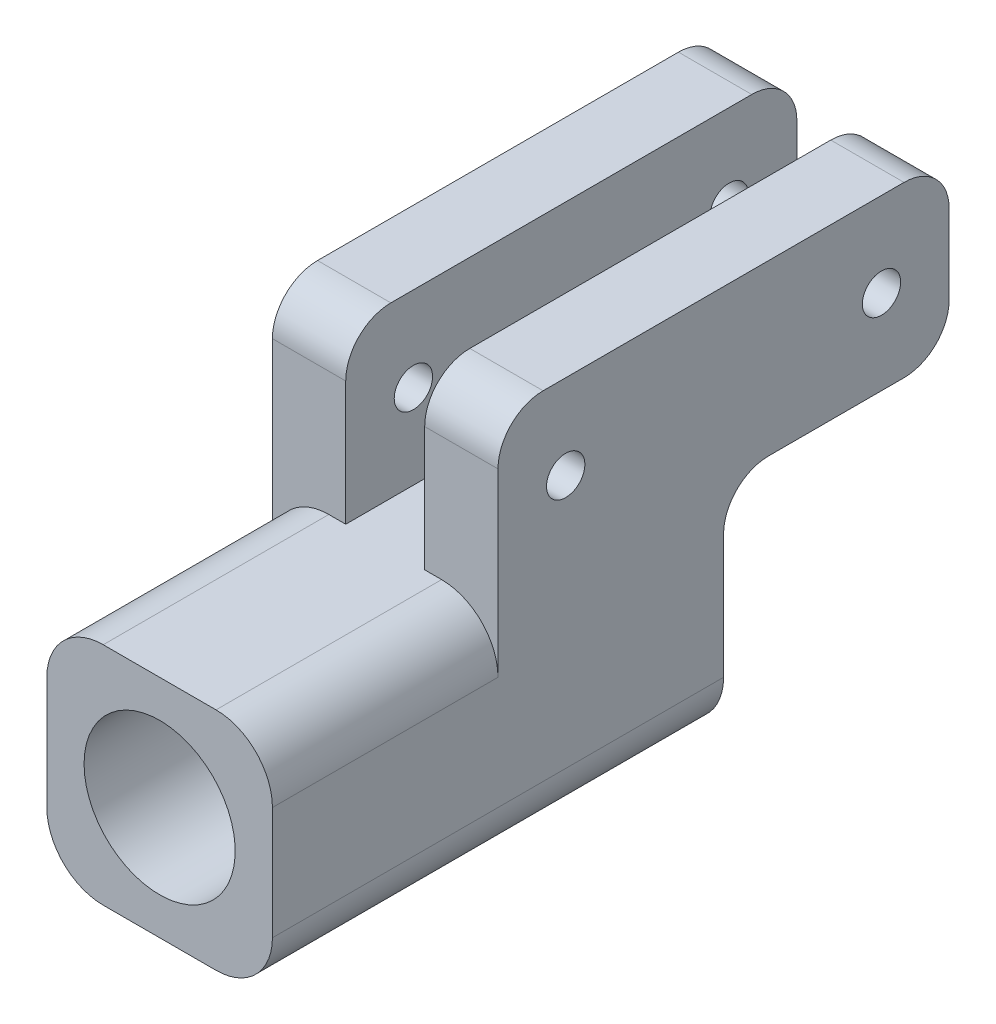
ISO-10303-21;
HEADER;
FILE_DESCRIPTION(('STEP AP214'),'2;1');
FILE_NAME('part.step','',(''),(''),'','','');
FILE_SCHEMA(('AUTOMOTIVE_DESIGN { 1 0 10303 214 1 1 1 1 }'));
ENDSEC;
DATA;
#1=APPLICATION_CONTEXT('core data for automotive mechanical design processes');
#2=APPLICATION_PROTOCOL_DEFINITION('international standard','automotive_design',2000,#1);
#3=PRODUCT_CONTEXT('',#1,'mechanical');
#4=PRODUCT('Part','Part','',(#3));
#5=PRODUCT_RELATED_PRODUCT_CATEGORY('part','',(#4));
#6=PRODUCT_DEFINITION_FORMATION('','',#4);
#7=PRODUCT_DEFINITION_CONTEXT('part definition',#1,'design');
#8=PRODUCT_DEFINITION('design','',#6,#7);
#9=PRODUCT_DEFINITION_SHAPE('','',#8);
#10=(LENGTH_UNIT() NAMED_UNIT(*) SI_UNIT(.MILLI.,.METRE.));
#11=(NAMED_UNIT(*) PLANE_ANGLE_UNIT() SI_UNIT($,.RADIAN.));
#12=(NAMED_UNIT(*) SI_UNIT($,.STERADIAN.) SOLID_ANGLE_UNIT());
#13=UNCERTAINTY_MEASURE_WITH_UNIT(LENGTH_MEASURE(1.E-05),#10,'distance_accuracy_value','');
#14=(GEOMETRIC_REPRESENTATION_CONTEXT(3) GLOBAL_UNCERTAINTY_ASSIGNED_CONTEXT((#13)) GLOBAL_UNIT_ASSIGNED_CONTEXT((#10,
#11,#12)) REPRESENTATION_CONTEXT('',''));
#15=CARTESIAN_POINT('',(0.,0.,0.));
#16=DIRECTION('',(0.,0.,1.));
#17=DIRECTION('',(1.,0.,0.));
#18=AXIS2_PLACEMENT_3D('',#15,#16,#17);
#19=CARTESIAN_POINT('',(10.,10.,-40.));
#20=DIRECTION('',(0.,1.,0.));
#21=DIRECTION('',(0.,0.,1.));
#22=AXIS2_PLACEMENT_3D('',#19,#20,#21);
#23=PLANE('',#22);
#24=DIRECTION('',(0.,0.,-1.));
#25=VECTOR('',#24,1.);
#26=CARTESIAN_POINT('',(-3.5,10.,-40.));
#27=LINE('',#26,#25);
#28=CARTESIAN_POINT('',(-3.5,10.,-24.));
#29=VERTEX_POINT('',#28);
#30=CARTESIAN_POINT('',(-3.5,10.,-36.));
#31=VERTEX_POINT('',#30);
#32=EDGE_CURVE('E460',#29,#31,#27,.T.);
#33=ORIENTED_EDGE('',*,*,#32,.F.);
#34=DIRECTION('',(-1.,0.,0.));
#35=VECTOR('',#34,1.);
#36=CARTESIAN_POINT('',(-10.,10.,-24.));
#37=LINE('',#36,#35);
#38=CARTESIAN_POINT('',(-10.,10.,-24.));
#39=VERTEX_POINT('',#38);
#40=EDGE_CURVE('E309',#29,#39,#37,.T.);
#41=ORIENTED_EDGE('',*,*,#40,.T.);
#42=DIRECTION('',(0.,0.,-1.));
#43=VECTOR('',#42,1.);
#44=CARTESIAN_POINT('',(-10.,10.,-40.));
#45=LINE('',#44,#43);
#46=CARTESIAN_POINT('',(-10.,10.,-36.));
#47=VERTEX_POINT('',#46);
#48=EDGE_CURVE('E253',#39,#47,#45,.T.);
#49=ORIENTED_EDGE('',*,*,#48,.T.);
#50=DIRECTION('',(-1.,0.,0.));
#51=VECTOR('',#50,1.);
#52=CARTESIAN_POINT('',(10.,10.,-36.));
#53=LINE('',#52,#51);
#54=EDGE_CURVE('E298',#47,#31,#53,.F.);
#55=ORIENTED_EDGE('',*,*,#54,.T.);
#56=EDGE_LOOP('',(#33,#41,#49,#55));
#57=FACE_BOUND('',#56,.T.);
#58=ADVANCED_FACE('F34',(#57),#23,.F.);
#59=CARTESIAN_POINT('',(10.,25.,-40.));
#60=DIRECTION('',(0.,0.,1.));
#61=DIRECTION('',(1.,0.,0.));
#62=AXIS2_PLACEMENT_3D('',#59,#60,#61);
#63=PLANE('',#62);
#64=DIRECTION('',(0.,1.,0.));
#65=VECTOR('',#64,1.);
#66=CARTESIAN_POINT('',(-10.,25.,-40.));
#67=LINE('',#66,#65);
#68=CARTESIAN_POINT('',(-10.,14.,-40.));
#69=VERTEX_POINT('',#68);
#70=CARTESIAN_POINT('',(-10.,21.,-40.));
#71=VERTEX_POINT('',#70);
#72=EDGE_CURVE('E268',#69,#71,#67,.T.);
#73=ORIENTED_EDGE('',*,*,#72,.T.);
#74=DIRECTION('',(-1.,0.,0.));
#75=VECTOR('',#74,1.);
#76=CARTESIAN_POINT('',(10.,21.,-40.));
#77=LINE('',#76,#75);
#78=CARTESIAN_POINT('',(-3.5,21.,-40.));
#79=VERTEX_POINT('',#78);
#80=EDGE_CURVE('E339',#71,#79,#77,.F.);
#81=ORIENTED_EDGE('',*,*,#80,.T.);
#82=DIRECTION('',(0.,1.,0.));
#83=VECTOR('',#82,1.);
#84=CARTESIAN_POINT('',(-3.5,-30.6078810084939,-40.));
#85=LINE('',#84,#83);
#86=CARTESIAN_POINT('',(-3.5,14.,-40.));
#87=VERTEX_POINT('',#86);
#88=EDGE_CURVE('E243',#87,#79,#85,.T.);
#89=ORIENTED_EDGE('',*,*,#88,.F.);
#90=DIRECTION('',(-1.,0.,0.));
#91=VECTOR('',#90,1.);
#92=CARTESIAN_POINT('',(10.,14.,-40.));
#93=LINE('',#92,#91);
#94=EDGE_CURVE('E336',#87,#69,#93,.T.);
#95=ORIENTED_EDGE('',*,*,#94,.T.);
#96=EDGE_LOOP('',(#73,#81,#89,#95));
#97=FACE_BOUND('',#96,.T.);
#98=ADVANCED_FACE('F491',(#97),#63,.F.);
#99=CARTESIAN_POINT('',(10.,25.,0.));
#100=DIRECTION('',(0.,-1.,0.));
#101=DIRECTION('',(0.,0.,-1.));
#102=AXIS2_PLACEMENT_3D('',#99,#100,#101);
#103=PLANE('',#102);
#104=DIRECTION('',(0.,0.,1.));
#105=VECTOR('',#104,1.);
#106=CARTESIAN_POINT('',(-3.5,25.,-40.));
#107=LINE('',#106,#105);
#108=CARTESIAN_POINT('',(-3.5,25.,-36.));
#109=VERTEX_POINT('',#108);
#110=CARTESIAN_POINT('',(-3.5,25.,-4.));
#111=VERTEX_POINT('',#110);
#112=EDGE_CURVE('E240',#109,#111,#107,.T.);
#113=ORIENTED_EDGE('',*,*,#112,.F.);
#114=DIRECTION('',(-1.,0.,0.));
#115=VECTOR('',#114,1.);
#116=CARTESIAN_POINT('',(10.,25.,-36.));
#117=LINE('',#116,#115);
#118=CARTESIAN_POINT('',(-10.,25.,-36.));
#119=VERTEX_POINT('',#118);
#120=EDGE_CURVE('E327',#109,#119,#117,.T.);
#121=ORIENTED_EDGE('',*,*,#120,.T.);
#122=DIRECTION('',(0.,0.,1.));
#123=VECTOR('',#122,1.);
#124=CARTESIAN_POINT('',(-10.,25.,0.));
#125=LINE('',#124,#123);
#126=CARTESIAN_POINT('',(-10.,25.,-4.));
#127=VERTEX_POINT('',#126);
#128=EDGE_CURVE('E271',#119,#127,#125,.T.);
#129=ORIENTED_EDGE('',*,*,#128,.T.);
#130=DIRECTION('',(-1.,0.,0.));
#131=VECTOR('',#130,1.);
#132=CARTESIAN_POINT('',(10.,25.,-4.));
#133=LINE('',#132,#131);
#134=EDGE_CURVE('E325',#127,#111,#133,.F.);
#135=ORIENTED_EDGE('',*,*,#134,.T.);
#136=EDGE_LOOP('',(#113,#121,#129,#135));
#137=FACE_BOUND('',#136,.T.);
#138=ADVANCED_FACE('F477',(#137),#103,.F.);
#139=CARTESIAN_POINT('',(10.,10.,0.));
#140=DIRECTION('',(0.,0.,-1.));
#141=DIRECTION('',(0.,1.,0.));
#142=AXIS2_PLACEMENT_3D('',#139,#140,#141);
#143=PLANE('',#142);
#144=DIRECTION('',(0.,1.,0.));
#145=VECTOR('',#144,1.);
#146=CARTESIAN_POINT('',(-3.5,-30.6078810084939,0.));
#147=LINE('',#146,#145);
#148=CARTESIAN_POINT('',(-3.5,10.,0.));
#149=VERTEX_POINT('',#148);
#150=CARTESIAN_POINT('',(-3.5,21.,0.));
#151=VERTEX_POINT('',#150);
#152=EDGE_CURVE('E459',#149,#151,#147,.T.);
#153=ORIENTED_EDGE('',*,*,#152,.T.);
#154=DIRECTION('',(-1.,0.,0.));
#155=VECTOR('',#154,1.);
#156=CARTESIAN_POINT('',(10.,21.,0.));
#157=LINE('',#156,#155);
#158=CARTESIAN_POINT('',(-10.,21.,0.));
#159=VERTEX_POINT('',#158);
#160=EDGE_CURVE('E370',#151,#159,#157,.T.);
#161=ORIENTED_EDGE('',*,*,#160,.T.);
#162=DIRECTION('',(0.,-1.,0.));
#163=VECTOR('',#162,1.);
#164=CARTESIAN_POINT('',(-10.,10.,0.));
#165=LINE('',#164,#163);
#166=CARTESIAN_POINT('',(-10.,5.,0.));
#167=VERTEX_POINT('',#166);
#168=EDGE_CURVE('E258',#159,#167,#165,.T.);
#169=ORIENTED_EDGE('',*,*,#168,.T.);
#170=CARTESIAN_POINT('',(-5.,5.,0.));
#171=DIRECTION('',(0.,0.,-1.));
#172=DIRECTION('',(0.,1.,0.));
#173=AXIS2_PLACEMENT_3D('',#170,#171,#172);
#174=CIRCLE('',#173,5.);
#175=CARTESIAN_POINT('',(-5.,10.,0.));
#176=VERTEX_POINT('',#175);
#177=EDGE_CURVE('E42',#167,#176,#174,.T.);
#178=ORIENTED_EDGE('',*,*,#177,.T.);
#179=DIRECTION('',(-1.,0.,0.));
#180=VECTOR('',#179,1.);
#181=CARTESIAN_POINT('',(10.,10.,0.));
#182=LINE('',#181,#180);
#183=EDGE_CURVE('E221',#149,#176,#182,.T.);
#184=ORIENTED_EDGE('',*,*,#183,.F.);
#185=EDGE_LOOP('',(#153,#161,#169,#178,#184));
#186=FACE_BOUND('',#185,.T.);
#187=ADVANCED_FACE('F413',(#186),#143,.F.);
#188=CARTESIAN_POINT('',(10.,10.,20.));
#189=DIRECTION('',(-1.,0.,0.));
#190=DIRECTION('',(0.,0.,1.));
#191=AXIS2_PLACEMENT_3D('',#188,#189,#190);
#192=PLANE('',#191);
#193=CARTESIAN_POINT('',(10.,17.5,-6.));
#194=DIRECTION('',(1.,0.,0.));
#195=DIRECTION('',(0.,0.,-1.));
#196=AXIS2_PLACEMENT_3D('',#193,#194,#195);
#197=CIRCLE('',#196,1.7);
#198=CARTESIAN_POINT('',(10.,17.5,-7.7));
#199=VERTEX_POINT('',#198);
#200=EDGE_CURVE('E805',#199,#199,#197,.T.);
#201=ORIENTED_EDGE('',*,*,#200,.F.);
#202=EDGE_LOOP('',(#201));
#203=FACE_BOUND('',#202,.T.);
#204=CARTESIAN_POINT('',(10.,17.5,-34.));
#205=DIRECTION('',(1.,0.,0.));
#206=DIRECTION('',(0.,0.,1.));
#207=AXIS2_PLACEMENT_3D('',#204,#205,#206);
#208=CIRCLE('',#207,1.70000000000001);
#209=CARTESIAN_POINT('',(10.,17.5,-32.3));
#210=VERTEX_POINT('',#209);
#211=EDGE_CURVE('E806',#210,#210,#208,.T.);
#212=ORIENTED_EDGE('',*,*,#211,.F.);
#213=EDGE_LOOP('',(#212));
#214=FACE_BOUND('',#213,.T.);
#215=DIRECTION('',(0.,-1.,0.));
#216=VECTOR('',#215,1.);
#217=CARTESIAN_POINT('',(10.,10.,0.));
#218=LINE('',#217,#216);
#219=CARTESIAN_POINT('',(10.,21.,0.));
#220=VERTEX_POINT('',#219);
#221=CARTESIAN_POINT('',(10.,5.,0.));
#222=VERTEX_POINT('',#221);
#223=EDGE_CURVE('E264',#220,#222,#218,.T.);
#224=ORIENTED_EDGE('',*,*,#223,.T.);
#225=DIRECTION('',(0.,0.,-1.));
#226=VECTOR('',#225,1.);
#227=CARTESIAN_POINT('',(10.,5.,20.));
#228=LINE('',#227,#226);
#229=CARTESIAN_POINT('',(10.,5.,20.));
#230=VERTEX_POINT('',#229);
#231=EDGE_CURVE('E402',#222,#230,#228,.F.);
#232=ORIENTED_EDGE('',*,*,#231,.T.);
#233=DIRECTION('',(0.,-1.,0.));
#234=VECTOR('',#233,1.);
#235=CARTESIAN_POINT('',(10.,10.,20.));
#236=LINE('',#235,#234);
#237=CARTESIAN_POINT('',(10.,-5.,20.));
#238=VERTEX_POINT('',#237);
#239=EDGE_CURVE('E283',#230,#238,#236,.T.);
#240=ORIENTED_EDGE('',*,*,#239,.T.);
#241=DIRECTION('',(0.,0.,-1.));
#242=VECTOR('',#241,1.);
#243=CARTESIAN_POINT('',(10.,-5.,-20.));
#244=LINE('',#243,#242);
#245=CARTESIAN_POINT('',(10.,-5.,-20.));
#246=VERTEX_POINT('',#245);
#247=EDGE_CURVE('E399',#238,#246,#244,.T.);
#248=ORIENTED_EDGE('',*,*,#247,.T.);
#249=DIRECTION('',(0.,-1.,0.));
#250=VECTOR('',#249,1.);
#251=CARTESIAN_POINT('',(10.,10.,-20.));
#252=LINE('',#251,#250);
#253=CARTESIAN_POINT('',(10.,6.,-20.));
#254=VERTEX_POINT('',#253);
#255=EDGE_CURVE('E296',#254,#246,#252,.T.);
#256=ORIENTED_EDGE('',*,*,#255,.F.);
#257=CARTESIAN_POINT('',(10.,6.,-24.));
#258=DIRECTION('',(-1.,0.,0.));
#259=DIRECTION('',(0.,0.,1.));
#260=AXIS2_PLACEMENT_3D('',#257,#258,#259);
#261=CIRCLE('',#260,4.);
#262=CARTESIAN_POINT('',(10.,10.,-24.));
#263=VERTEX_POINT('',#262);
#264=EDGE_CURVE('E379',#254,#263,#261,.T.);
#265=ORIENTED_EDGE('',*,*,#264,.T.);
#266=DIRECTION('',(0.,0.,-1.));
#267=VECTOR('',#266,1.);
#268=CARTESIAN_POINT('',(10.,10.,-40.));
#269=LINE('',#268,#267);
#270=CARTESIAN_POINT('',(10.,10.,-36.));
#271=VERTEX_POINT('',#270);
#272=EDGE_CURVE('E254',#263,#271,#269,.T.);
#273=ORIENTED_EDGE('',*,*,#272,.T.);
#274=CARTESIAN_POINT('',(10.,14.,-36.));
#275=DIRECTION('',(-1.,0.,0.));
#276=DIRECTION('',(0.,0.,1.));
#277=AXIS2_PLACEMENT_3D('',#274,#275,#276);
#278=CIRCLE('',#277,4.);
#279=CARTESIAN_POINT('',(10.,14.,-40.));
#280=VERTEX_POINT('',#279);
#281=EDGE_CURVE('E363',#271,#280,#278,.F.);
#282=ORIENTED_EDGE('',*,*,#281,.T.);
#283=DIRECTION('',(0.,1.,0.));
#284=VECTOR('',#283,1.);
#285=CARTESIAN_POINT('',(10.,25.,-40.));
#286=LINE('',#285,#284);
#287=CARTESIAN_POINT('',(10.,21.,-40.));
#288=VERTEX_POINT('',#287);
#289=EDGE_CURVE('E257',#280,#288,#286,.T.);
#290=ORIENTED_EDGE('',*,*,#289,.T.);
#291=CARTESIAN_POINT('',(10.,21.,-36.));
#292=DIRECTION('',(-1.,0.,0.));
#293=DIRECTION('',(0.,0.,1.));
#294=AXIS2_PLACEMENT_3D('',#291,#292,#293);
#295=CIRCLE('',#294,4.);
#296=CARTESIAN_POINT('',(10.,25.,-36.));
#297=VERTEX_POINT('',#296);
#298=EDGE_CURVE('E367',#288,#297,#295,.F.);
#299=ORIENTED_EDGE('',*,*,#298,.T.);
#300=DIRECTION('',(0.,0.,1.));
#301=VECTOR('',#300,1.);
#302=CARTESIAN_POINT('',(10.,25.,0.));
#303=LINE('',#302,#301);
#304=CARTESIAN_POINT('',(10.,25.,-4.));
#305=VERTEX_POINT('',#304);
#306=EDGE_CURVE('E261',#297,#305,#303,.T.);
#307=ORIENTED_EDGE('',*,*,#306,.T.);
#308=CARTESIAN_POINT('',(10.,21.,-4.));
#309=DIRECTION('',(-1.,0.,0.));
#310=DIRECTION('',(0.,0.,1.));
#311=AXIS2_PLACEMENT_3D('',#308,#309,#310);
#312=CIRCLE('',#311,4.);
#313=EDGE_CURVE('E365',#305,#220,#312,.F.);
#314=ORIENTED_EDGE('',*,*,#313,.T.);
#315=EDGE_LOOP('',(#224,#232,#240,#248,#256,#265,#273,#282,#290,#299,#307,#314));
#316=FACE_BOUND('',#315,.T.);
#317=ADVANCED_FACE('F440',(#203,#214,#316),#192,.F.);
#318=CARTESIAN_POINT('',(-10.,10.,-20.));
#319=DIRECTION('',(0.,0.,1.));
#320=DIRECTION('',(1.,0.,0.));
#321=AXIS2_PLACEMENT_3D('',#318,#319,#320);
#322=PLANE('',#321);
#323=CARTESIAN_POINT('',(0.,0.,-20.));
#324=DIRECTION('',(0.,0.,-1.));
#325=DIRECTION('',(-1.,0.,0.));
#326=AXIS2_PLACEMENT_3D('',#323,#324,#325);
#327=CIRCLE('',#326,6.7);
#328=CARTESIAN_POINT('',(-6.7,0.,-20.));
#329=VERTEX_POINT('',#328);
#330=EDGE_CURVE('E220',#329,#329,#327,.T.);
#331=ORIENTED_EDGE('',*,*,#330,.F.);
#332=EDGE_LOOP('',(#331));
#333=FACE_BOUND('',#332,.T.);
#334=DIRECTION('',(-1.,0.,0.));
#335=VECTOR('',#334,1.);
#336=CARTESIAN_POINT('',(-10.,-10.,-20.));
#337=LINE('',#336,#335);
#338=CARTESIAN_POINT('',(5.,-10.,-20.));
#339=VERTEX_POINT('',#338);
#340=CARTESIAN_POINT('',(-5.,-10.,-20.));
#341=VERTEX_POINT('',#340);
#342=EDGE_CURVE('E280',#339,#341,#337,.T.);
#343=ORIENTED_EDGE('',*,*,#342,.T.);
#344=CARTESIAN_POINT('',(-5.,-5.,-20.));
#345=DIRECTION('',(0.,0.,1.));
#346=DIRECTION('',(1.,0.,0.));
#347=AXIS2_PLACEMENT_3D('',#344,#345,#346);
#348=CIRCLE('',#347,5.);
#349=CARTESIAN_POINT('',(-10.,-5.,-20.));
#350=VERTEX_POINT('',#349);
#351=EDGE_CURVE('E408',#341,#350,#348,.F.);
#352=ORIENTED_EDGE('',*,*,#351,.T.);
#353=DIRECTION('',(0.,-1.,0.));
#354=VECTOR('',#353,1.);
#355=CARTESIAN_POINT('',(-10.,10.,-20.));
#356=LINE('',#355,#354);
#357=CARTESIAN_POINT('',(-10.,6.,-20.));
#358=VERTEX_POINT('',#357);
#359=EDGE_CURVE('E293',#358,#350,#356,.T.);
#360=ORIENTED_EDGE('',*,*,#359,.F.);
#361=DIRECTION('',(-1.,0.,0.));
#362=VECTOR('',#361,1.);
#363=CARTESIAN_POINT('',(-3.5,6.,-20.));
#364=LINE('',#363,#362);
#365=CARTESIAN_POINT('',(-3.5,6.,-20.));
#366=VERTEX_POINT('',#365);
#367=EDGE_CURVE('E317',#358,#366,#364,.F.);
#368=ORIENTED_EDGE('',*,*,#367,.T.);
#369=DIRECTION('',(0.,1.,0.));
#370=VECTOR('',#369,1.);
#371=CARTESIAN_POINT('',(-3.5,-30.6078810084939,-20.));
#372=LINE('',#371,#370);
#373=CARTESIAN_POINT('',(-3.5,10.,-20.));
#374=VERTEX_POINT('',#373);
#375=EDGE_CURVE('E315',#366,#374,#372,.T.);
#376=ORIENTED_EDGE('',*,*,#375,.T.);
#377=DIRECTION('',(-1.,0.,0.));
#378=VECTOR('',#377,1.);
#379=CARTESIAN_POINT('',(-10.,10.,-20.));
#380=LINE('',#379,#378);
#381=CARTESIAN_POINT('',(3.5,10.,-20.));
#382=VERTEX_POINT('',#381);
#383=EDGE_CURVE('E251',#382,#374,#380,.T.);
#384=ORIENTED_EDGE('',*,*,#383,.F.);
#385=DIRECTION('',(0.,-1.,0.));
#386=VECTOR('',#385,1.);
#387=CARTESIAN_POINT('',(3.5,-30.6078810084939,-20.));
#388=LINE('',#387,#386);
#389=CARTESIAN_POINT('',(3.5,6.,-20.));
#390=VERTEX_POINT('',#389);
#391=EDGE_CURVE('E229',#382,#390,#388,.T.);
#392=ORIENTED_EDGE('',*,*,#391,.T.);
#393=DIRECTION('',(-1.,0.,0.));
#394=VECTOR('',#393,1.);
#395=CARTESIAN_POINT('',(10.,6.,-20.));
#396=LINE('',#395,#394);
#397=EDGE_CURVE('E312',#390,#254,#396,.F.);
#398=ORIENTED_EDGE('',*,*,#397,.T.);
#399=ORIENTED_EDGE('',*,*,#255,.T.);
#400=CARTESIAN_POINT('',(5.,-5.,-20.));
#401=DIRECTION('',(0.,0.,1.));
#402=DIRECTION('',(1.,0.,0.));
#403=AXIS2_PLACEMENT_3D('',#400,#401,#402);
#404=CIRCLE('',#403,5.);
#405=EDGE_CURVE('E56',#246,#339,#404,.F.);
#406=ORIENTED_EDGE('',*,*,#405,.T.);
#407=EDGE_LOOP('',(#343,#352,#360,#368,#376,#384,#392,#398,#399,#406));
#408=FACE_BOUND('',#407,.T.);
#409=ADVANCED_FACE('F496',(#333,#408),#322,.F.);
#410=CARTESIAN_POINT('',(-10.,10.,20.));
#411=DIRECTION('',(1.,0.,0.));
#412=DIRECTION('',(0.,0.,-1.));
#413=AXIS2_PLACEMENT_3D('',#410,#411,#412);
#414=PLANE('',#413);
#415=CARTESIAN_POINT('',(-10.,17.5,-6.));
#416=DIRECTION('',(1.,0.,0.));
#417=DIRECTION('',(0.,0.,-1.));
#418=AXIS2_PLACEMENT_3D('',#415,#416,#417);
#419=CIRCLE('',#418,1.7);
#420=CARTESIAN_POINT('',(-10.,17.5,-7.7));
#421=VERTEX_POINT('',#420);
#422=EDGE_CURVE('E303',#421,#421,#419,.F.);
#423=ORIENTED_EDGE('',*,*,#422,.F.);
#424=EDGE_LOOP('',(#423));
#425=FACE_BOUND('',#424,.T.);
#426=CARTESIAN_POINT('',(-10.,17.5,-34.));
#427=DIRECTION('',(1.,0.,0.));
#428=DIRECTION('',(0.,0.,-1.));
#429=AXIS2_PLACEMENT_3D('',#426,#427,#428);
#430=CIRCLE('',#429,1.70000000000001);
#431=CARTESIAN_POINT('',(-10.,17.5,-35.7));
#432=VERTEX_POINT('',#431);
#433=EDGE_CURVE('E802',#432,#432,#430,.F.);
#434=ORIENTED_EDGE('',*,*,#433,.F.);
#435=EDGE_LOOP('',(#434));
#436=FACE_BOUND('',#435,.T.);
#437=DIRECTION('',(0.,-1.,0.));
#438=VECTOR('',#437,1.);
#439=CARTESIAN_POINT('',(-10.,10.,20.));
#440=LINE('',#439,#438);
#441=CARTESIAN_POINT('',(-10.,5.,20.));
#442=VERTEX_POINT('',#441);
#443=CARTESIAN_POINT('',(-10.,-5.,20.));
#444=VERTEX_POINT('',#443);
#445=EDGE_CURVE('E290',#442,#444,#440,.T.);
#446=ORIENTED_EDGE('',*,*,#445,.F.);
#447=DIRECTION('',(0.,0.,1.));
#448=VECTOR('',#447,1.);
#449=CARTESIAN_POINT('',(-10.,5.,20.));
#450=LINE('',#449,#448);
#451=EDGE_CURVE('E396',#442,#167,#450,.F.);
#452=ORIENTED_EDGE('',*,*,#451,.T.);
#453=ORIENTED_EDGE('',*,*,#168,.F.);
#454=CARTESIAN_POINT('',(-10.,21.,-4.));
#455=DIRECTION('',(1.,0.,0.));
#456=DIRECTION('',(0.,0.,-1.));
#457=AXIS2_PLACEMENT_3D('',#454,#455,#456);
#458=CIRCLE('',#457,4.);
#459=EDGE_CURVE('E332',#159,#127,#458,.F.);
#460=ORIENTED_EDGE('',*,*,#459,.T.);
#461=ORIENTED_EDGE('',*,*,#128,.F.);
#462=CARTESIAN_POINT('',(-10.,21.,-36.));
#463=DIRECTION('',(1.,0.,0.));
#464=DIRECTION('',(0.,0.,-1.));
#465=AXIS2_PLACEMENT_3D('',#462,#463,#464);
#466=CIRCLE('',#465,4.);
#467=EDGE_CURVE('E334',#119,#71,#466,.F.);
#468=ORIENTED_EDGE('',*,*,#467,.T.);
#469=ORIENTED_EDGE('',*,*,#72,.F.);
#470=CARTESIAN_POINT('',(-10.,14.,-36.));
#471=DIRECTION('',(1.,0.,0.));
#472=DIRECTION('',(0.,0.,-1.));
#473=AXIS2_PLACEMENT_3D('',#470,#471,#472);
#474=CIRCLE('',#473,4.);
#475=EDGE_CURVE('E330',#69,#47,#474,.F.);
#476=ORIENTED_EDGE('',*,*,#475,.T.);
#477=ORIENTED_EDGE('',*,*,#48,.F.);
#478=CARTESIAN_POINT('',(-10.,6.,-24.));
#479=DIRECTION('',(1.,0.,0.));
#480=DIRECTION('',(0.,0.,-1.));
#481=AXIS2_PLACEMENT_3D('',#478,#479,#480);
#482=CIRCLE('',#481,4.);
#483=EDGE_CURVE('E373',#39,#358,#482,.T.);
#484=ORIENTED_EDGE('',*,*,#483,.T.);
#485=ORIENTED_EDGE('',*,*,#359,.T.);
#486=DIRECTION('',(0.,0.,1.));
#487=VECTOR('',#486,1.);
#488=CARTESIAN_POINT('',(-10.,-5.,20.));
#489=LINE('',#488,#487);
#490=EDGE_CURVE('E393',#350,#444,#489,.T.);
#491=ORIENTED_EDGE('',*,*,#490,.T.);
#492=EDGE_LOOP('',(#446,#452,#453,#460,#461,#468,#469,#476,#477,#484,#485,#491));
#493=FACE_BOUND('',#492,.T.);
#494=ADVANCED_FACE('F426',(#425,#436,#493),#414,.F.);
#495=CARTESIAN_POINT('',(-10.,10.,20.));
#496=DIRECTION('',(0.,0.,-1.));
#497=DIRECTION('',(-1.,0.,0.));
#498=AXIS2_PLACEMENT_3D('',#495,#496,#497);
#499=PLANE('',#498);
#500=CARTESIAN_POINT('',(0.,0.,20.));
#501=DIRECTION('',(0.,0.,-1.));
#502=DIRECTION('',(-1.,0.,0.));
#503=AXIS2_PLACEMENT_3D('',#500,#501,#502);
#504=CIRCLE('',#503,6.7);
#505=CARTESIAN_POINT('',(-6.7,0.,20.));
#506=VERTEX_POINT('',#505);
#507=EDGE_CURVE('E277',#506,#506,#504,.F.);
#508=ORIENTED_EDGE('',*,*,#507,.F.);
#509=EDGE_LOOP('',(#508));
#510=FACE_BOUND('',#509,.T.);
#511=DIRECTION('',(1.,0.,0.));
#512=VECTOR('',#511,1.);
#513=CARTESIAN_POINT('',(-10.,10.,20.));
#514=LINE('',#513,#512);
#515=CARTESIAN_POINT('',(-5.,10.,20.));
#516=VERTEX_POINT('',#515);
#517=CARTESIAN_POINT('',(5.,10.,20.));
#518=VERTEX_POINT('',#517);
#519=EDGE_CURVE('E281',#516,#518,#514,.T.);
#520=ORIENTED_EDGE('',*,*,#519,.F.);
#521=CARTESIAN_POINT('',(-5.,5.,20.));
#522=DIRECTION('',(0.,0.,-1.));
#523=DIRECTION('',(-1.,0.,0.));
#524=AXIS2_PLACEMENT_3D('',#521,#522,#523);
#525=CIRCLE('',#524,5.);
#526=EDGE_CURVE('E391',#516,#442,#525,.F.);
#527=ORIENTED_EDGE('',*,*,#526,.T.);
#528=ORIENTED_EDGE('',*,*,#445,.T.);
#529=CARTESIAN_POINT('',(-5.,-5.,20.));
#530=DIRECTION('',(0.,0.,-1.));
#531=DIRECTION('',(-1.,0.,0.));
#532=AXIS2_PLACEMENT_3D('',#529,#530,#531);
#533=CIRCLE('',#532,5.);
#534=CARTESIAN_POINT('',(-5.,-10.,20.));
#535=VERTEX_POINT('',#534);
#536=EDGE_CURVE('E387',#444,#535,#533,.F.);
#537=ORIENTED_EDGE('',*,*,#536,.T.);
#538=DIRECTION('',(1.,0.,0.));
#539=VECTOR('',#538,1.);
#540=CARTESIAN_POINT('',(-10.,-10.,20.));
#541=LINE('',#540,#539);
#542=CARTESIAN_POINT('',(5.,-10.,20.));
#543=VERTEX_POINT('',#542);
#544=EDGE_CURVE('E284',#535,#543,#541,.T.);
#545=ORIENTED_EDGE('',*,*,#544,.T.);
#546=CARTESIAN_POINT('',(5.,-5.,20.));
#547=DIRECTION('',(0.,0.,-1.));
#548=DIRECTION('',(-1.,0.,0.));
#549=AXIS2_PLACEMENT_3D('',#546,#547,#548);
#550=CIRCLE('',#549,5.);
#551=EDGE_CURVE('E385',#543,#238,#550,.F.);
#552=ORIENTED_EDGE('',*,*,#551,.T.);
#553=ORIENTED_EDGE('',*,*,#239,.F.);
#554=CARTESIAN_POINT('',(5.,5.,20.));
#555=DIRECTION('',(0.,0.,-1.));
#556=DIRECTION('',(-1.,0.,0.));
#557=AXIS2_PLACEMENT_3D('',#554,#555,#556);
#558=CIRCLE('',#557,5.);
#559=EDGE_CURVE('E389',#230,#518,#558,.F.);
#560=ORIENTED_EDGE('',*,*,#559,.T.);
#561=EDGE_LOOP('',(#520,#527,#528,#537,#545,#552,#553,#560));
#562=FACE_BOUND('',#561,.T.);
#563=ADVANCED_FACE('F424',(#510,#562),#499,.F.);
#564=CARTESIAN_POINT('',(0.,10.,0.));
#565=DIRECTION('',(0.,-1.,0.));
#566=DIRECTION('',(0.,0.,-1.));
#567=AXIS2_PLACEMENT_3D('',#564,#565,#566);
#568=PLANE('',#567);
#569=ORIENTED_EDGE('',*,*,#183,.T.);
#570=DIRECTION('',(0.,0.,1.));
#571=VECTOR('',#570,1.);
#572=CARTESIAN_POINT('',(-5.,10.,0.));
#573=LINE('',#572,#571);
#574=EDGE_CURVE('E382',#176,#516,#573,.T.);
#575=ORIENTED_EDGE('',*,*,#574,.T.);
#576=ORIENTED_EDGE('',*,*,#519,.T.);
#577=DIRECTION('',(0.,0.,-1.));
#578=VECTOR('',#577,1.);
#579=CARTESIAN_POINT('',(5.,10.,0.));
#580=LINE('',#579,#578);
#581=CARTESIAN_POINT('',(5.,10.,0.));
#582=VERTEX_POINT('',#581);
#583=EDGE_CURVE('E217',#518,#582,#580,.T.);
#584=ORIENTED_EDGE('',*,*,#583,.T.);
#585=CARTESIAN_POINT('',(3.5,9.99999999999999,0.));
#586=VERTEX_POINT('',#585);
#587=EDGE_CURVE('E209',#582,#586,#182,.T.);
#588=ORIENTED_EDGE('',*,*,#587,.T.);
#589=DIRECTION('',(0.,0.,1.));
#590=VECTOR('',#589,1.);
#591=CARTESIAN_POINT('',(3.5,9.99999999999999,0.));
#592=LINE('',#591,#590);
#593=EDGE_CURVE('E214',#382,#586,#592,.T.);
#594=ORIENTED_EDGE('',*,*,#593,.F.);
#595=ORIENTED_EDGE('',*,*,#383,.T.);
#596=EDGE_CURVE('E232',#149,#374,#27,.T.);
#597=ORIENTED_EDGE('',*,*,#596,.F.);
#598=EDGE_LOOP('',(#569,#575,#576,#584,#588,#594,#595,#597));
#599=FACE_BOUND('',#598,.T.);
#600=ADVANCED_FACE('F212',(#599),#568,.F.);
#601=CARTESIAN_POINT('',(0.,-10.,0.));
#602=DIRECTION('',(0.,-1.,0.));
#603=DIRECTION('',(0.,0.,-1.));
#604=AXIS2_PLACEMENT_3D('',#601,#602,#603);
#605=PLANE('',#604);
#606=ORIENTED_EDGE('',*,*,#544,.F.);
#607=DIRECTION('',(0.,0.,1.));
#608=VECTOR('',#607,1.);
#609=CARTESIAN_POINT('',(-5.,-10.,-20.));
#610=LINE('',#609,#608);
#611=EDGE_CURVE('E49',#535,#341,#610,.F.);
#612=ORIENTED_EDGE('',*,*,#611,.T.);
#613=ORIENTED_EDGE('',*,*,#342,.F.);
#614=DIRECTION('',(0.,0.,-1.));
#615=VECTOR('',#614,1.);
#616=CARTESIAN_POINT('',(5.,-10.,20.));
#617=LINE('',#616,#615);
#618=EDGE_CURVE('E404',#339,#543,#617,.F.);
#619=ORIENTED_EDGE('',*,*,#618,.T.);
#620=EDGE_LOOP('',(#606,#612,#613,#619));
#621=FACE_BOUND('',#620,.T.);
#622=ADVANCED_FACE('F433',(#621),#605,.T.);
#623=CARTESIAN_POINT('',(0.,0.,38.9504617357995));
#624=DIRECTION('',(0.,0.,-1.));
#625=DIRECTION('',(-1.,0.,0.));
#626=AXIS2_PLACEMENT_3D('',#623,#624,#625);
#627=CYLINDRICAL_SURFACE('',#626,6.7);
#628=ORIENTED_EDGE('',*,*,#507,.T.);
#629=EDGE_LOOP('',(#628));
#630=FACE_BOUND('',#629,.T.);
#631=ORIENTED_EDGE('',*,*,#330,.T.);
#632=EDGE_LOOP('',(#631));
#633=FACE_BOUND('',#632,.T.);
#634=ADVANCED_FACE('F535',(#630,#633),#627,.F.);
#635=ORIENTED_EDGE('',*,*,#272,.F.);
#636=DIRECTION('',(-1.,0.,0.));
#637=VECTOR('',#636,1.);
#638=CARTESIAN_POINT('',(3.5,10.,-24.));
#639=LINE('',#638,#637);
#640=CARTESIAN_POINT('',(3.5,10.,-24.));
#641=VERTEX_POINT('',#640);
#642=EDGE_CURVE('E322',#263,#641,#639,.T.);
#643=ORIENTED_EDGE('',*,*,#642,.T.);
#644=CARTESIAN_POINT('',(3.5,10.,-36.));
#645=VERTEX_POINT('',#644);
#646=EDGE_CURVE('E231',#645,#641,#592,.T.);
#647=ORIENTED_EDGE('',*,*,#646,.F.);
#648=DIRECTION('',(-1.,0.,0.));
#649=VECTOR('',#648,1.);
#650=CARTESIAN_POINT('',(10.,10.,-36.));
#651=LINE('',#650,#649);
#652=EDGE_CURVE('E320',#645,#271,#651,.F.);
#653=ORIENTED_EDGE('',*,*,#652,.T.);
#654=EDGE_LOOP('',(#635,#643,#647,#653));
#655=FACE_BOUND('',#654,.T.);
#656=ADVANCED_FACE('F505',(#655),#23,.F.);
#657=DIRECTION('',(0.,1.,0.));
#658=VECTOR('',#657,1.);
#659=CARTESIAN_POINT('',(3.5,-30.6078810084939,-40.));
#660=LINE('',#659,#658);
#661=CARTESIAN_POINT('',(3.5,14.,-40.));
#662=VERTEX_POINT('',#661);
#663=CARTESIAN_POINT('',(3.5,21.,-40.));
#664=VERTEX_POINT('',#663);
#665=EDGE_CURVE('E239',#662,#664,#660,.T.);
#666=ORIENTED_EDGE('',*,*,#665,.T.);
#667=DIRECTION('',(-1.,0.,0.));
#668=VECTOR('',#667,1.);
#669=CARTESIAN_POINT('',(10.,21.,-40.));
#670=LINE('',#669,#668);
#671=EDGE_CURVE('E361',#664,#288,#670,.F.);
#672=ORIENTED_EDGE('',*,*,#671,.T.);
#673=ORIENTED_EDGE('',*,*,#289,.F.);
#674=DIRECTION('',(-1.,0.,0.));
#675=VECTOR('',#674,1.);
#676=CARTESIAN_POINT('',(10.,14.,-40.));
#677=LINE('',#676,#675);
#678=EDGE_CURVE('E358',#280,#662,#677,.T.);
#679=ORIENTED_EDGE('',*,*,#678,.T.);
#680=EDGE_LOOP('',(#666,#672,#673,#679));
#681=FACE_BOUND('',#680,.T.);
#682=ADVANCED_FACE('F514',(#681),#63,.F.);
#683=ORIENTED_EDGE('',*,*,#306,.F.);
#684=DIRECTION('',(-1.,0.,0.));
#685=VECTOR('',#684,1.);
#686=CARTESIAN_POINT('',(10.,25.,-36.));
#687=LINE('',#686,#685);
#688=CARTESIAN_POINT('',(3.5,25.,-36.));
#689=VERTEX_POINT('',#688);
#690=EDGE_CURVE('E349',#297,#689,#687,.T.);
#691=ORIENTED_EDGE('',*,*,#690,.T.);
#692=DIRECTION('',(0.,0.,-1.));
#693=VECTOR('',#692,1.);
#694=CARTESIAN_POINT('',(3.5,25.,0.));
#695=LINE('',#694,#693);
#696=CARTESIAN_POINT('',(3.5,25.,-4.));
#697=VERTEX_POINT('',#696);
#698=EDGE_CURVE('E246',#697,#689,#695,.T.);
#699=ORIENTED_EDGE('',*,*,#698,.F.);
#700=DIRECTION('',(-1.,0.,0.));
#701=VECTOR('',#700,1.);
#702=CARTESIAN_POINT('',(10.,25.,-4.));
#703=LINE('',#702,#701);
#704=EDGE_CURVE('E347',#697,#305,#703,.F.);
#705=ORIENTED_EDGE('',*,*,#704,.T.);
#706=EDGE_LOOP('',(#683,#691,#699,#705));
#707=FACE_BOUND('',#706,.T.);
#708=ADVANCED_FACE('F452',(#707),#103,.F.);
#709=ORIENTED_EDGE('',*,*,#223,.F.);
#710=DIRECTION('',(-1.,0.,0.));
#711=VECTOR('',#710,1.);
#712=CARTESIAN_POINT('',(10.,21.,0.));
#713=LINE('',#712,#711);
#714=CARTESIAN_POINT('',(3.5,21.,0.));
#715=VERTEX_POINT('',#714);
#716=EDGE_CURVE('E238',#220,#715,#713,.T.);
#717=ORIENTED_EDGE('',*,*,#716,.T.);
#718=DIRECTION('',(0.,1.,0.));
#719=VECTOR('',#718,1.);
#720=CARTESIAN_POINT('',(3.5,-30.6078810084939,0.));
#721=LINE('',#720,#719);
#722=EDGE_CURVE('E227',#586,#715,#721,.T.);
#723=ORIENTED_EDGE('',*,*,#722,.F.);
#724=ORIENTED_EDGE('',*,*,#587,.F.);
#725=CARTESIAN_POINT('',(5.,5.,0.));
#726=DIRECTION('',(0.,0.,-1.));
#727=DIRECTION('',(0.,1.,0.));
#728=AXIS2_PLACEMENT_3D('',#725,#726,#727);
#729=CIRCLE('',#728,5.);
#730=EDGE_CURVE('E11',#582,#222,#729,.T.);
#731=ORIENTED_EDGE('',*,*,#730,.T.);
#732=EDGE_LOOP('',(#709,#717,#723,#724,#731));
#733=FACE_BOUND('',#732,.T.);
#734=ADVANCED_FACE('F236',(#733),#143,.F.);
#735=CARTESIAN_POINT('',(-3.5,-30.6078810084939,-40.));
#736=DIRECTION('',(-1.,0.,0.));
#737=DIRECTION('',(0.,0.,1.));
#738=AXIS2_PLACEMENT_3D('',#735,#736,#737);
#739=PLANE('',#738);
#740=CARTESIAN_POINT('',(-3.5,17.5,-6.));
#741=DIRECTION('',(-1.,0.,0.));
#742=DIRECTION('',(0.,0.,1.));
#743=AXIS2_PLACEMENT_3D('',#740,#741,#742);
#744=CIRCLE('',#743,1.7);
#745=CARTESIAN_POINT('',(-3.5,17.5,-4.3));
#746=VERTEX_POINT('',#745);
#747=EDGE_CURVE('E307',#746,#746,#744,.T.);
#748=ORIENTED_EDGE('',*,*,#747,.T.);
#749=EDGE_LOOP('',(#748));
#750=FACE_BOUND('',#749,.T.);
#751=CARTESIAN_POINT('',(-3.5,17.5,-34.));
#752=DIRECTION('',(-1.,0.,0.));
#753=DIRECTION('',(0.,0.,1.));
#754=AXIS2_PLACEMENT_3D('',#751,#752,#753);
#755=CIRCLE('',#754,1.70000000000001);
#756=CARTESIAN_POINT('',(-3.5,17.5,-32.3));
#757=VERTEX_POINT('',#756);
#758=EDGE_CURVE('E302',#757,#757,#755,.T.);
#759=ORIENTED_EDGE('',*,*,#758,.T.);
#760=EDGE_LOOP('',(#759));
#761=FACE_BOUND('',#760,.T.);
#762=ORIENTED_EDGE('',*,*,#88,.T.);
#763=CARTESIAN_POINT('',(-3.5,21.,-36.));
#764=DIRECTION('',(-1.,0.,0.));
#765=DIRECTION('',(0.,0.,1.));
#766=AXIS2_PLACEMENT_3D('',#763,#764,#765);
#767=CIRCLE('',#766,4.);
#768=EDGE_CURVE('E345',#79,#109,#767,.F.);
#769=ORIENTED_EDGE('',*,*,#768,.T.);
#770=ORIENTED_EDGE('',*,*,#112,.T.);
#771=CARTESIAN_POINT('',(-3.5,21.,-4.));
#772=DIRECTION('',(-1.,0.,0.));
#773=DIRECTION('',(0.,0.,1.));
#774=AXIS2_PLACEMENT_3D('',#771,#772,#773);
#775=CIRCLE('',#774,4.);
#776=EDGE_CURVE('E343',#111,#151,#775,.F.);
#777=ORIENTED_EDGE('',*,*,#776,.T.);
#778=ORIENTED_EDGE('',*,*,#152,.F.);
#779=ORIENTED_EDGE('',*,*,#596,.T.);
#780=ORIENTED_EDGE('',*,*,#375,.F.);
#781=CARTESIAN_POINT('',(-3.5,6.,-24.));
#782=DIRECTION('',(-1.,0.,0.));
#783=DIRECTION('',(0.,0.,1.));
#784=AXIS2_PLACEMENT_3D('',#781,#782,#783);
#785=CIRCLE('',#784,4.);
#786=EDGE_CURVE('E375',#366,#29,#785,.T.);
#787=ORIENTED_EDGE('',*,*,#786,.T.);
#788=ORIENTED_EDGE('',*,*,#32,.T.);
#789=CARTESIAN_POINT('',(-3.5,14.,-36.));
#790=DIRECTION('',(-1.,0.,0.));
#791=DIRECTION('',(0.,0.,1.));
#792=AXIS2_PLACEMENT_3D('',#789,#790,#791);
#793=CIRCLE('',#792,4.);
#794=EDGE_CURVE('E341',#31,#87,#793,.F.);
#795=ORIENTED_EDGE('',*,*,#794,.T.);
#796=EDGE_LOOP('',(#762,#769,#770,#777,#778,#779,#780,#787,#788,#795));
#797=FACE_BOUND('',#796,.T.);
#798=ADVANCED_FACE('F465',(#750,#761,#797),#739,.F.);
#799=CARTESIAN_POINT('',(3.5,-30.6078810084939,0.));
#800=DIRECTION('',(1.,0.,0.));
#801=DIRECTION('',(0.,0.,-1.));
#802=AXIS2_PLACEMENT_3D('',#799,#800,#801);
#803=PLANE('',#802);
#804=CARTESIAN_POINT('',(3.5,17.5,-6.));
#805=DIRECTION('',(1.,0.,0.));
#806=DIRECTION('',(0.,0.,-1.));
#807=AXIS2_PLACEMENT_3D('',#804,#805,#806);
#808=CIRCLE('',#807,1.7);
#809=CARTESIAN_POINT('',(3.5,17.5,-7.7));
#810=VERTEX_POINT('',#809);
#811=EDGE_CURVE('E304',#810,#810,#808,.T.);
#812=ORIENTED_EDGE('',*,*,#811,.T.);
#813=EDGE_LOOP('',(#812));
#814=FACE_BOUND('',#813,.T.);
#815=CARTESIAN_POINT('',(3.5,17.5,-34.));
#816=DIRECTION('',(1.,0.,0.));
#817=DIRECTION('',(0.,0.,-1.));
#818=AXIS2_PLACEMENT_3D('',#815,#816,#817);
#819=CIRCLE('',#818,1.70000000000001);
#820=CARTESIAN_POINT('',(3.5,17.5,-35.7));
#821=VERTEX_POINT('',#820);
#822=EDGE_CURVE('E299',#821,#821,#819,.T.);
#823=ORIENTED_EDGE('',*,*,#822,.T.);
#824=EDGE_LOOP('',(#823));
#825=FACE_BOUND('',#824,.T.);
#826=ORIENTED_EDGE('',*,*,#698,.T.);
#827=CARTESIAN_POINT('',(3.5,21.,-36.));
#828=DIRECTION('',(1.,0.,0.));
#829=DIRECTION('',(0.,0.,-1.));
#830=AXIS2_PLACEMENT_3D('',#827,#828,#829);
#831=CIRCLE('',#830,4.);
#832=EDGE_CURVE('E356',#689,#664,#831,.F.);
#833=ORIENTED_EDGE('',*,*,#832,.T.);
#834=ORIENTED_EDGE('',*,*,#665,.F.);
#835=CARTESIAN_POINT('',(3.5,14.,-36.));
#836=DIRECTION('',(1.,0.,0.));
#837=DIRECTION('',(0.,0.,-1.));
#838=AXIS2_PLACEMENT_3D('',#835,#836,#837);
#839=CIRCLE('',#838,4.);
#840=EDGE_CURVE('E352',#662,#645,#839,.F.);
#841=ORIENTED_EDGE('',*,*,#840,.T.);
#842=ORIENTED_EDGE('',*,*,#646,.T.);
#843=CARTESIAN_POINT('',(3.5,6.,-24.));
#844=DIRECTION('',(1.,0.,0.));
#845=DIRECTION('',(0.,0.,-1.));
#846=AXIS2_PLACEMENT_3D('',#843,#844,#845);
#847=CIRCLE('',#846,4.);
#848=EDGE_CURVE('E377',#641,#390,#847,.T.);
#849=ORIENTED_EDGE('',*,*,#848,.T.);
#850=ORIENTED_EDGE('',*,*,#391,.F.);
#851=ORIENTED_EDGE('',*,*,#593,.T.);
#852=ORIENTED_EDGE('',*,*,#722,.T.);
#853=CARTESIAN_POINT('',(3.5,21.,-4.));
#854=DIRECTION('',(1.,0.,0.));
#855=DIRECTION('',(0.,0.,-1.));
#856=AXIS2_PLACEMENT_3D('',#853,#854,#855);
#857=CIRCLE('',#856,4.);
#858=EDGE_CURVE('E354',#715,#697,#857,.F.);
#859=ORIENTED_EDGE('',*,*,#858,.T.);
#860=EDGE_LOOP('',(#826,#833,#834,#841,#842,#849,#850,#851,#852,#859));
#861=FACE_BOUND('',#860,.T.);
#862=ADVANCED_FACE('F226',(#814,#825,#861),#803,.F.);
#863=CARTESIAN_POINT('',(-14.8083261120685,17.5,-34.));
#864=DIRECTION('',(1.,0.,0.));
#865=DIRECTION('',(0.,0.,-1.));
#866=AXIS2_PLACEMENT_3D('',#863,#864,#865);
#867=CYLINDRICAL_SURFACE('',#866,1.70000000000001);
#868=ORIENTED_EDGE('',*,*,#211,.T.);
#869=EDGE_LOOP('',(#868));
#870=FACE_BOUND('',#869,.T.);
#871=ORIENTED_EDGE('',*,*,#822,.F.);
#872=EDGE_LOOP('',(#871));
#873=FACE_BOUND('',#872,.T.);
#874=ADVANCED_FACE('F716',(#870,#873),#867,.F.);
#875=CARTESIAN_POINT('',(-14.8083261120685,17.5,-6.));
#876=DIRECTION('',(1.,0.,0.));
#877=DIRECTION('',(0.,0.,-1.));
#878=AXIS2_PLACEMENT_3D('',#875,#876,#877);
#879=CYLINDRICAL_SURFACE('',#878,1.7);
#880=ORIENTED_EDGE('',*,*,#200,.T.);
#881=EDGE_LOOP('',(#880));
#882=FACE_BOUND('',#881,.T.);
#883=ORIENTED_EDGE('',*,*,#811,.F.);
#884=EDGE_LOOP('',(#883));
#885=FACE_BOUND('',#884,.T.);
#886=ADVANCED_FACE('F724',(#882,#885),#879,.F.);
#887=ORIENTED_EDGE('',*,*,#433,.T.);
#888=EDGE_LOOP('',(#887));
#889=FACE_BOUND('',#888,.T.);
#890=ORIENTED_EDGE('',*,*,#758,.F.);
#891=EDGE_LOOP('',(#890));
#892=FACE_BOUND('',#891,.T.);
#893=ADVANCED_FACE('F727',(#889,#892),#867,.F.);
#894=ORIENTED_EDGE('',*,*,#422,.T.);
#895=EDGE_LOOP('',(#894));
#896=FACE_BOUND('',#895,.T.);
#897=ORIENTED_EDGE('',*,*,#747,.F.);
#898=EDGE_LOOP('',(#897));
#899=FACE_BOUND('',#898,.T.);
#900=ADVANCED_FACE('F563',(#896,#899),#879,.F.);
#901=CARTESIAN_POINT('',(10.,6.,-24.));
#902=DIRECTION('',(1.,0.,0.));
#903=DIRECTION('',(0.,0.,-1.));
#904=AXIS2_PLACEMENT_3D('',#901,#902,#903);
#905=CYLINDRICAL_SURFACE('',#904,4.);
#906=ORIENTED_EDGE('',*,*,#786,.F.);
#907=ORIENTED_EDGE('',*,*,#367,.F.);
#908=ORIENTED_EDGE('',*,*,#483,.F.);
#909=ORIENTED_EDGE('',*,*,#40,.F.);
#910=EDGE_LOOP('',(#906,#907,#908,#909));
#911=FACE_BOUND('',#910,.T.);
#912=ADVANCED_FACE('F494',(#911),#905,.F.);
#913=CARTESIAN_POINT('',(10.,6.,-24.));
#914=DIRECTION('',(1.,0.,0.));
#915=DIRECTION('',(0.,0.,-1.));
#916=AXIS2_PLACEMENT_3D('',#913,#914,#915);
#917=CYLINDRICAL_SURFACE('',#916,4.);
#918=ORIENTED_EDGE('',*,*,#264,.F.);
#919=ORIENTED_EDGE('',*,*,#397,.F.);
#920=ORIENTED_EDGE('',*,*,#848,.F.);
#921=ORIENTED_EDGE('',*,*,#642,.F.);
#922=EDGE_LOOP('',(#918,#919,#920,#921));
#923=FACE_BOUND('',#922,.T.);
#924=ADVANCED_FACE('F500',(#923),#917,.F.);
#925=CARTESIAN_POINT('',(10.,21.,-36.));
#926=DIRECTION('',(-1.,0.,0.));
#927=DIRECTION('',(0.,0.,1.));
#928=AXIS2_PLACEMENT_3D('',#925,#926,#927);
#929=CYLINDRICAL_SURFACE('',#928,4.);
#930=ORIENTED_EDGE('',*,*,#768,.F.);
#931=ORIENTED_EDGE('',*,*,#80,.F.);
#932=ORIENTED_EDGE('',*,*,#467,.F.);
#933=ORIENTED_EDGE('',*,*,#120,.F.);
#934=EDGE_LOOP('',(#930,#931,#932,#933));
#935=FACE_BOUND('',#934,.T.);
#936=ADVANCED_FACE('F474',(#935),#929,.T.);
#937=CARTESIAN_POINT('',(10.,21.,-36.));
#938=DIRECTION('',(-1.,0.,0.));
#939=DIRECTION('',(0.,0.,1.));
#940=AXIS2_PLACEMENT_3D('',#937,#938,#939);
#941=CYLINDRICAL_SURFACE('',#940,4.);
#942=ORIENTED_EDGE('',*,*,#298,.F.);
#943=ORIENTED_EDGE('',*,*,#671,.F.);
#944=ORIENTED_EDGE('',*,*,#832,.F.);
#945=ORIENTED_EDGE('',*,*,#690,.F.);
#946=EDGE_LOOP('',(#942,#943,#944,#945));
#947=FACE_BOUND('',#946,.T.);
#948=ADVANCED_FACE('F518',(#947),#941,.T.);
#949=CARTESIAN_POINT('',(10.,21.,-4.));
#950=DIRECTION('',(-1.,0.,0.));
#951=DIRECTION('',(0.,0.,1.));
#952=AXIS2_PLACEMENT_3D('',#949,#950,#951);
#953=CYLINDRICAL_SURFACE('',#952,4.);
#954=ORIENTED_EDGE('',*,*,#313,.F.);
#955=ORIENTED_EDGE('',*,*,#704,.F.);
#956=ORIENTED_EDGE('',*,*,#858,.F.);
#957=ORIENTED_EDGE('',*,*,#716,.F.);
#958=EDGE_LOOP('',(#954,#955,#956,#957));
#959=FACE_BOUND('',#958,.T.);
#960=ADVANCED_FACE('F447',(#959),#953,.T.);
#961=CARTESIAN_POINT('',(10.,21.,-4.));
#962=DIRECTION('',(-1.,0.,0.));
#963=DIRECTION('',(0.,0.,1.));
#964=AXIS2_PLACEMENT_3D('',#961,#962,#963);
#965=CYLINDRICAL_SURFACE('',#964,4.);
#966=ORIENTED_EDGE('',*,*,#776,.F.);
#967=ORIENTED_EDGE('',*,*,#134,.F.);
#968=ORIENTED_EDGE('',*,*,#459,.F.);
#969=ORIENTED_EDGE('',*,*,#160,.F.);
#970=EDGE_LOOP('',(#966,#967,#968,#969));
#971=FACE_BOUND('',#970,.T.);
#972=ADVANCED_FACE('F483',(#971),#965,.T.);
#973=CARTESIAN_POINT('',(10.,14.,-36.));
#974=DIRECTION('',(-1.,0.,0.));
#975=DIRECTION('',(0.,0.,1.));
#976=AXIS2_PLACEMENT_3D('',#973,#974,#975);
#977=CYLINDRICAL_SURFACE('',#976,4.);
#978=ORIENTED_EDGE('',*,*,#794,.F.);
#979=ORIENTED_EDGE('',*,*,#54,.F.);
#980=ORIENTED_EDGE('',*,*,#475,.F.);
#981=ORIENTED_EDGE('',*,*,#94,.F.);
#982=EDGE_LOOP('',(#978,#979,#980,#981));
#983=FACE_BOUND('',#982,.T.);
#984=ADVANCED_FACE('F490',(#983),#977,.T.);
#985=CARTESIAN_POINT('',(10.,14.,-36.));
#986=DIRECTION('',(-1.,0.,0.));
#987=DIRECTION('',(0.,0.,1.));
#988=AXIS2_PLACEMENT_3D('',#985,#986,#987);
#989=CYLINDRICAL_SURFACE('',#988,4.);
#990=ORIENTED_EDGE('',*,*,#281,.F.);
#991=ORIENTED_EDGE('',*,*,#652,.F.);
#992=ORIENTED_EDGE('',*,*,#840,.F.);
#993=ORIENTED_EDGE('',*,*,#678,.F.);
#994=EDGE_LOOP('',(#990,#991,#992,#993));
#995=FACE_BOUND('',#994,.T.);
#996=ADVANCED_FACE('F509',(#995),#989,.T.);
#997=CARTESIAN_POINT('',(-5.,5.,0.));
#998=DIRECTION('',(0.,0.,1.));
#999=DIRECTION('',(1.,0.,0.));
#1000=AXIS2_PLACEMENT_3D('',#997,#998,#999);
#1001=CYLINDRICAL_SURFACE('',#1000,5.);
#1002=ORIENTED_EDGE('',*,*,#177,.F.);
#1003=ORIENTED_EDGE('',*,*,#451,.F.);
#1004=ORIENTED_EDGE('',*,*,#526,.F.);
#1005=ORIENTED_EDGE('',*,*,#574,.F.);
#1006=EDGE_LOOP('',(#1002,#1003,#1004,#1005));
#1007=FACE_BOUND('',#1006,.T.);
#1008=ADVANCED_FACE('F421',(#1007),#1001,.T.);
#1009=CARTESIAN_POINT('',(5.,5.,0.));
#1010=DIRECTION('',(0.,0.,-1.));
#1011=DIRECTION('',(-1.,0.,0.));
#1012=AXIS2_PLACEMENT_3D('',#1009,#1010,#1011);
#1013=CYLINDRICAL_SURFACE('',#1012,5.);
#1014=ORIENTED_EDGE('',*,*,#559,.F.);
#1015=ORIENTED_EDGE('',*,*,#231,.F.);
#1016=ORIENTED_EDGE('',*,*,#730,.F.);
#1017=ORIENTED_EDGE('',*,*,#583,.F.);
#1018=EDGE_LOOP('',(#1014,#1015,#1016,#1017));
#1019=FACE_BOUND('',#1018,.T.);
#1020=ADVANCED_FACE('F444',(#1019),#1013,.T.);
#1021=CARTESIAN_POINT('',(-5.,-5.,20.));
#1022=DIRECTION('',(0.,0.,-1.));
#1023=DIRECTION('',(-1.,0.,0.));
#1024=AXIS2_PLACEMENT_3D('',#1021,#1022,#1023);
#1025=CYLINDRICAL_SURFACE('',#1024,5.);
#1026=ORIENTED_EDGE('',*,*,#351,.F.);
#1027=ORIENTED_EDGE('',*,*,#611,.F.);
#1028=ORIENTED_EDGE('',*,*,#536,.F.);
#1029=ORIENTED_EDGE('',*,*,#490,.F.);
#1030=EDGE_LOOP('',(#1026,#1027,#1028,#1029));
#1031=FACE_BOUND('',#1030,.T.);
#1032=ADVANCED_FACE('F431',(#1031),#1025,.T.);
#1033=CARTESIAN_POINT('',(5.,-5.,20.));
#1034=DIRECTION('',(0.,0.,1.));
#1035=DIRECTION('',(1.,0.,0.));
#1036=AXIS2_PLACEMENT_3D('',#1033,#1034,#1035);
#1037=CYLINDRICAL_SURFACE('',#1036,5.);
#1038=ORIENTED_EDGE('',*,*,#551,.F.);
#1039=ORIENTED_EDGE('',*,*,#618,.F.);
#1040=ORIENTED_EDGE('',*,*,#405,.F.);
#1041=ORIENTED_EDGE('',*,*,#247,.F.);
#1042=EDGE_LOOP('',(#1038,#1039,#1040,#1041));
#1043=FACE_BOUND('',#1042,.T.);
#1044=ADVANCED_FACE('F36',(#1043),#1037,.T.);
#1045=CLOSED_SHELL('',(#58,#98,#138,#187,#317,#409,#494,#563,#600,#622,#634,#656,#682,#708,#734,
#798,#862,#874,#886,#893,#900,#912,#924,#936,#948,#960,#972,#984,#996,#1008,#1020,#1032,#1044));
#1046=MANIFOLD_SOLID_BREP('B2',#1045);
#1047=ADVANCED_BREP_SHAPE_REPRESENTATION('',(#18,#1046),#14);
#1048=SHAPE_DEFINITION_REPRESENTATION(#9,#1047);
ENDSEC;
END-ISO-10303-21;
